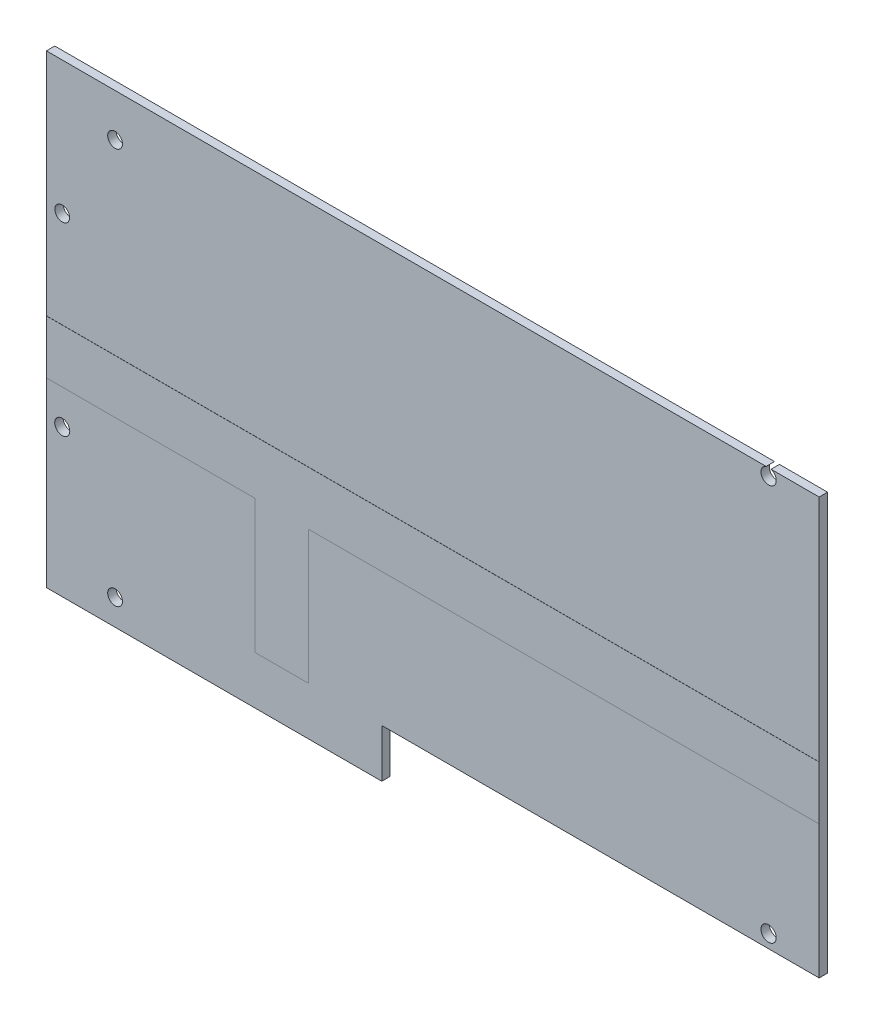
ISO-10303-21;
HEADER;
FILE_DESCRIPTION(('STEP AP214'),'2;1');
FILE_NAME('part.step','',(''),(''),'','','');
FILE_SCHEMA(('AUTOMOTIVE_DESIGN { 1 0 10303 214 1 1 1 1 }'));
ENDSEC;
DATA;
#1=APPLICATION_CONTEXT('core data for automotive mechanical design processes');
#2=APPLICATION_PROTOCOL_DEFINITION('international standard','automotive_design',2000,#1);
#3=PRODUCT_CONTEXT('',#1,'mechanical');
#4=PRODUCT('Part','Part','',(#3));
#5=PRODUCT_RELATED_PRODUCT_CATEGORY('part','',(#4));
#6=PRODUCT_DEFINITION_FORMATION('','',#4);
#7=PRODUCT_DEFINITION_CONTEXT('part definition',#1,'design');
#8=PRODUCT_DEFINITION('design','',#6,#7);
#9=PRODUCT_DEFINITION_SHAPE('','',#8);
#10=(LENGTH_UNIT() NAMED_UNIT(*) SI_UNIT(.MILLI.,.METRE.));
#11=(NAMED_UNIT(*) PLANE_ANGLE_UNIT() SI_UNIT($,.RADIAN.));
#12=(NAMED_UNIT(*) SI_UNIT($,.STERADIAN.) SOLID_ANGLE_UNIT());
#13=UNCERTAINTY_MEASURE_WITH_UNIT(LENGTH_MEASURE(1.E-05),#10,'distance_accuracy_value','');
#14=(GEOMETRIC_REPRESENTATION_CONTEXT(3) GLOBAL_UNCERTAINTY_ASSIGNED_CONTEXT((#13)) GLOBAL_UNIT_ASSIGNED_CONTEXT((#10,
#11,#12)) REPRESENTATION_CONTEXT('',''));
#15=CARTESIAN_POINT('',(0.,0.,0.));
#16=DIRECTION('',(0.,0.,1.));
#17=DIRECTION('',(1.,0.,0.));
#18=AXIS2_PLACEMENT_3D('',#15,#16,#17);
#19=CARTESIAN_POINT('',(-73.152,-30.353,1.5875));
#20=DIRECTION('',(0.,1.,0.));
#21=DIRECTION('',(-1.,0.,0.));
#22=AXIS2_PLACEMENT_3D('',#19,#20,#21);
#23=PLANE('',#22);
#24=DIRECTION('',(1.,0.,0.));
#25=VECTOR('',#24,1.);
#26=CARTESIAN_POINT('',(-73.152,-30.353,0.));
#27=LINE('',#26,#25);
#28=CARTESIAN_POINT('',(-33.6423,-30.353,0.));
#29=VERTEX_POINT('',#28);
#30=CARTESIAN_POINT('',(-23.4823,-30.353,0.));
#31=VERTEX_POINT('',#30);
#32=EDGE_CURVE('E11',#29,#31,#27,.T.);
#33=ORIENTED_EDGE('',*,*,#32,.F.);
#34=DIRECTION('',(0.,0.,1.));
#35=VECTOR('',#34,1.);
#36=CARTESIAN_POINT('',(-33.6423,-30.353,-0.0379000000000002));
#37=LINE('',#36,#35);
#38=CARTESIAN_POINT('',(-33.6423,-30.353,-0.0379000000000002));
#39=VERTEX_POINT('',#38);
#40=EDGE_CURVE('E354',#39,#29,#37,.T.);
#41=ORIENTED_EDGE('',*,*,#40,.F.);
#42=DIRECTION('',(1.,0.,0.));
#43=VECTOR('',#42,1.);
#44=CARTESIAN_POINT('',(-33.6423,-30.353,-0.0379000000000002));
#45=LINE('',#44,#43);
#46=CARTESIAN_POINT('',(-23.4823,-30.353,-0.0379000000000002));
#47=VERTEX_POINT('',#46);
#48=EDGE_CURVE('E310',#39,#47,#45,.T.);
#49=ORIENTED_EDGE('',*,*,#48,.T.);
#50=DIRECTION('',(0.,0.,1.));
#51=VECTOR('',#50,1.);
#52=CARTESIAN_POINT('',(-23.4823,-30.353,-0.0379000000000002));
#53=LINE('',#52,#51);
#54=EDGE_CURVE('E349',#47,#31,#53,.T.);
#55=ORIENTED_EDGE('',*,*,#54,.T.);
#56=EDGE_LOOP('',(#33,#41,#49,#55));
#57=FACE_BOUND('',#56,.T.);
#58=ADVANCED_FACE('F41',(#57),#23,.F.);
#59=DIRECTION('',(-1.,0.,0.));
#60=VECTOR('',#59,1.);
#61=CARTESIAN_POINT('',(-73.152,-30.353,1.5875));
#62=LINE('',#61,#60);
#63=CARTESIAN_POINT('',(-23.4823,-30.353,1.5875));
#64=VERTEX_POINT('',#63);
#65=CARTESIAN_POINT('',(-33.6423,-30.353,1.5875));
#66=VERTEX_POINT('',#65);
#67=EDGE_CURVE('E51',#64,#66,#62,.T.);
#68=ORIENTED_EDGE('',*,*,#67,.F.);
#69=CARTESIAN_POINT('',(-23.4823,-30.353,1.6129));
#70=VERTEX_POINT('',#69);
#71=EDGE_CURVE('E353',#64,#70,#53,.T.);
#72=ORIENTED_EDGE('',*,*,#71,.T.);
#73=DIRECTION('',(1.,0.,0.));
#74=VECTOR('',#73,1.);
#75=CARTESIAN_POINT('',(-33.6423,-30.353,1.6129));
#76=LINE('',#75,#74);
#77=CARTESIAN_POINT('',(-33.6423,-30.353,1.6129));
#78=VERTEX_POINT('',#77);
#79=EDGE_CURVE('E278',#78,#70,#76,.T.);
#80=ORIENTED_EDGE('',*,*,#79,.F.);
#81=EDGE_CURVE('E358',#66,#78,#37,.T.);
#82=ORIENTED_EDGE('',*,*,#81,.F.);
#83=EDGE_LOOP('',(#68,#72,#80,#82));
#84=FACE_BOUND('',#83,.T.);
#85=ADVANCED_FACE('F486',(#84),#23,.F.);
#86=DIRECTION('',(0.,0.,1.));
#87=VECTOR('',#86,1.);
#88=CARTESIAN_POINT('',(-9.65200000000001,-30.353,-64.1549899540168));
#89=LINE('',#88,#87);
#90=CARTESIAN_POINT('',(-9.65200000000001,-30.353,0.));
#91=VERTEX_POINT('',#90);
#92=CARTESIAN_POINT('',(-9.65200000000001,-30.353,1.5875));
#93=VERTEX_POINT('',#92);
#94=EDGE_CURVE('E59',#91,#93,#89,.T.);
#95=ORIENTED_EDGE('',*,*,#94,.F.);
#96=DIRECTION('',(1.,0.,0.));
#97=VECTOR('',#96,1.);
#98=CARTESIAN_POINT('',(-73.152,-30.353,0.));
#99=LINE('',#98,#97);
#100=CARTESIAN_POINT('',(73.152,-30.353,0.));
#101=VERTEX_POINT('',#100);
#102=EDGE_CURVE('E401',#91,#101,#99,.T.);
#103=ORIENTED_EDGE('',*,*,#102,.T.);
#104=DIRECTION('',(0.,0.,-1.));
#105=VECTOR('',#104,1.);
#106=CARTESIAN_POINT('',(73.152,-30.353,1.5875));
#107=LINE('',#106,#105);
#108=CARTESIAN_POINT('',(73.152,-30.353,1.5875));
#109=VERTEX_POINT('',#108);
#110=EDGE_CURVE('E420',#109,#101,#107,.T.);
#111=ORIENTED_EDGE('',*,*,#110,.F.);
#112=DIRECTION('',(1.,0.,0.));
#113=VECTOR('',#112,1.);
#114=CARTESIAN_POINT('',(-73.152,-30.353,1.5875));
#115=LINE('',#114,#113);
#116=EDGE_CURVE('E384',#93,#109,#115,.T.);
#117=ORIENTED_EDGE('',*,*,#116,.F.);
#118=EDGE_LOOP('',(#95,#103,#111,#117));
#119=FACE_BOUND('',#118,.T.);
#120=ADVANCED_FACE('F488',(#119),#23,.F.);
#121=CARTESIAN_POINT('',(-73.152,48.514,1.5875));
#122=DIRECTION('',(0.,-1.,0.));
#123=DIRECTION('',(0.,0.,-1.));
#124=AXIS2_PLACEMENT_3D('',#121,#122,#123);
#125=PLANE('',#124);
#126=DIRECTION('',(-1.,0.,0.));
#127=VECTOR('',#126,1.);
#128=CARTESIAN_POINT('',(-73.152,48.514,0.));
#129=LINE('',#128,#127);
#130=CARTESIAN_POINT('',(73.152,48.514,0.));
#131=VERTEX_POINT('',#130);
#132=CARTESIAN_POINT('',(64.0483332147094,48.514,0.));
#133=VERTEX_POINT('',#132);
#134=EDGE_CURVE('E218',#131,#133,#129,.T.);
#135=ORIENTED_EDGE('',*,*,#134,.T.);
#136=DIRECTION('',(0.,0.,1.));
#137=VECTOR('',#136,1.);
#138=CARTESIAN_POINT('',(64.0483332147094,48.514,-0.0379000000000002));
#139=LINE('',#138,#137);
#140=CARTESIAN_POINT('',(64.0483332147094,48.514,1.5875));
#141=VERTEX_POINT('',#140);
#142=EDGE_CURVE('E247',#133,#141,#139,.T.);
#143=ORIENTED_EDGE('',*,*,#142,.T.);
#144=DIRECTION('',(-1.,0.,0.));
#145=VECTOR('',#144,1.);
#146=CARTESIAN_POINT('',(-73.152,48.514,1.5875));
#147=LINE('',#146,#145);
#148=CARTESIAN_POINT('',(73.152,48.514,1.5875));
#149=VERTEX_POINT('',#148);
#150=EDGE_CURVE('E392',#149,#141,#147,.T.);
#151=ORIENTED_EDGE('',*,*,#150,.F.);
#152=DIRECTION('',(0.,0.,-1.));
#153=VECTOR('',#152,1.);
#154=CARTESIAN_POINT('',(73.152,48.514,1.5875));
#155=LINE('',#154,#153);
#156=EDGE_CURVE('E416',#149,#131,#155,.T.);
#157=ORIENTED_EDGE('',*,*,#156,.T.);
#158=EDGE_LOOP('',(#135,#143,#151,#157));
#159=FACE_BOUND('',#158,.T.);
#160=ADVANCED_FACE('F495',(#159),#125,.F.);
#161=CARTESIAN_POINT('',(0.,0.,1.5875));
#162=DIRECTION('',(0.,0.,1.));
#163=DIRECTION('',(1.,0.,0.));
#164=AXIS2_PLACEMENT_3D('',#161,#162,#163);
#165=PLANE('',#164);
#166=CARTESIAN_POINT('',(-60.152,40.424999886,1.5875));
#167=DIRECTION('',(0.,0.,1.));
#168=DIRECTION('',(1.,0.,0.));
#169=AXIS2_PLACEMENT_3D('',#166,#167,#168);
#170=CIRCLE('',#169,1.39700000000001);
#171=CARTESIAN_POINT('',(-58.755,40.424999886,1.5875));
#172=VERTEX_POINT('',#171);
#173=EDGE_CURVE('E549',#172,#172,#170,.T.);
#174=ORIENTED_EDGE('',*,*,#173,.F.);
#175=EDGE_LOOP('',(#174));
#176=FACE_BOUND('',#175,.T.);
#177=CARTESIAN_POINT('',(-70.152,23.35,1.5875));
#178=DIRECTION('',(0.,0.,1.));
#179=DIRECTION('',(1.,0.,0.));
#180=AXIS2_PLACEMENT_3D('',#177,#178,#179);
#181=CIRCLE('',#180,1.39700000000001);
#182=CARTESIAN_POINT('',(-68.755,23.35,1.5875));
#183=VERTEX_POINT('',#182);
#184=EDGE_CURVE('E458',#183,#183,#181,.T.);
#185=ORIENTED_EDGE('',*,*,#184,.F.);
#186=EDGE_LOOP('',(#185));
#187=FACE_BOUND('',#186,.T.);
#188=CARTESIAN_POINT('',(63.58,47.147,1.5875));
#189=DIRECTION('',(0.,0.,1.));
#190=DIRECTION('',(1.,0.,0.));
#191=AXIS2_PLACEMENT_3D('',#188,#189,#190);
#192=CIRCLE('',#191,1.44500000000001);
#193=CARTESIAN_POINT('',(63.1116667852906,48.514,1.5875));
#194=VERTEX_POINT('',#193);
#195=EDGE_CURVE('E257',#194,#141,#192,.T.);
#196=ORIENTED_EDGE('',*,*,#195,.F.);
#197=CARTESIAN_POINT('',(-73.152,48.514,1.5875));
#198=VERTEX_POINT('',#197);
#199=EDGE_CURVE('E391',#194,#198,#147,.T.);
#200=ORIENTED_EDGE('',*,*,#199,.T.);
#201=DIRECTION('',(0.,-1.,0.));
#202=VECTOR('',#201,1.);
#203=CARTESIAN_POINT('',(-73.152,48.514,1.5875));
#204=LINE('',#203,#202);
#205=CARTESIAN_POINT('',(-73.152,5.08000000000002,1.5875));
#206=VERTEX_POINT('',#205);
#207=EDGE_CURVE('E217',#198,#206,#204,.T.);
#208=ORIENTED_EDGE('',*,*,#207,.T.);
#209=DIRECTION('',(-1.,0.,0.));
#210=VECTOR('',#209,1.);
#211=CARTESIAN_POINT('',(0.,5.08,1.5875));
#212=LINE('',#211,#210);
#213=CARTESIAN_POINT('',(73.152,5.08000000000002,1.5875));
#214=VERTEX_POINT('',#213);
#215=EDGE_CURVE('E379',#214,#206,#212,.T.);
#216=ORIENTED_EDGE('',*,*,#215,.F.);
#217=DIRECTION('',(0.,1.,0.));
#218=VECTOR('',#217,1.);
#219=CARTESIAN_POINT('',(73.152,48.514,1.5875));
#220=LINE('',#219,#218);
#221=EDGE_CURVE('E387',#214,#149,#220,.T.);
#222=ORIENTED_EDGE('',*,*,#221,.T.);
#223=ORIENTED_EDGE('',*,*,#150,.T.);
#224=EDGE_LOOP('',(#196,#200,#208,#216,#222,#223));
#225=FACE_BOUND('',#224,.T.);
#226=ADVANCED_FACE('F499',(#176,#187,#225),#165,.T.);
#227=CARTESIAN_POINT('',(0.,0.,0.));
#228=DIRECTION('',(0.,0.,1.));
#229=DIRECTION('',(1.,0.,0.));
#230=AXIS2_PLACEMENT_3D('',#227,#228,#229);
#231=PLANE('',#230);
#232=CARTESIAN_POINT('',(-60.152,40.424999886,0.));
#233=DIRECTION('',(0.,0.,1.));
#234=DIRECTION('',(1.,0.,0.));
#235=AXIS2_PLACEMENT_3D('',#232,#233,#234);
#236=CIRCLE('',#235,1.39700000000001);
#237=CARTESIAN_POINT('',(-58.755,40.424999886,0.));
#238=VERTEX_POINT('',#237);
#239=EDGE_CURVE('E45',#238,#238,#236,.T.);
#240=ORIENTED_EDGE('',*,*,#239,.T.);
#241=EDGE_LOOP('',(#240));
#242=FACE_BOUND('',#241,.T.);
#243=CARTESIAN_POINT('',(-70.152,23.35,0.));
#244=DIRECTION('',(0.,0.,1.));
#245=DIRECTION('',(1.,0.,0.));
#246=AXIS2_PLACEMENT_3D('',#243,#244,#245);
#247=CIRCLE('',#246,1.39700000000001);
#248=CARTESIAN_POINT('',(-68.755,23.35,0.));
#249=VERTEX_POINT('',#248);
#250=EDGE_CURVE('E241',#249,#249,#247,.T.);
#251=ORIENTED_EDGE('',*,*,#250,.T.);
#252=EDGE_LOOP('',(#251));
#253=FACE_BOUND('',#252,.T.);
#254=CARTESIAN_POINT('',(63.1116667852906,48.514,0.));
#255=VERTEX_POINT('',#254);
#256=CARTESIAN_POINT('',(-73.152,48.514,0.));
#257=VERTEX_POINT('',#256);
#258=EDGE_CURVE('E409',#255,#257,#129,.T.);
#259=ORIENTED_EDGE('',*,*,#258,.F.);
#260=CARTESIAN_POINT('',(63.58,47.147,0.));
#261=DIRECTION('',(0.,0.,1.));
#262=DIRECTION('',(1.,0.,0.));
#263=AXIS2_PLACEMENT_3D('',#260,#261,#262);
#264=CIRCLE('',#263,1.44500000000001);
#265=EDGE_CURVE('E67',#255,#133,#264,.T.);
#266=ORIENTED_EDGE('',*,*,#265,.T.);
#267=ORIENTED_EDGE('',*,*,#134,.F.);
#268=DIRECTION('',(0.,1.,0.));
#269=VECTOR('',#268,1.);
#270=CARTESIAN_POINT('',(73.152,48.514,0.));
#271=LINE('',#270,#269);
#272=CARTESIAN_POINT('',(73.152,5.08,0.));
#273=VERTEX_POINT('',#272);
#274=EDGE_CURVE('E404',#273,#131,#271,.T.);
#275=ORIENTED_EDGE('',*,*,#274,.F.);
#276=DIRECTION('',(-1.,0.,0.));
#277=VECTOR('',#276,1.);
#278=CARTESIAN_POINT('',(0.,5.08,0.));
#279=LINE('',#278,#277);
#280=CARTESIAN_POINT('',(-73.152,5.08,0.));
#281=VERTEX_POINT('',#280);
#282=EDGE_CURVE('E440',#273,#281,#279,.T.);
#283=ORIENTED_EDGE('',*,*,#282,.T.);
#284=DIRECTION('',(0.,-1.,0.));
#285=VECTOR('',#284,1.);
#286=CARTESIAN_POINT('',(-73.152,48.514,0.));
#287=LINE('',#286,#285);
#288=EDGE_CURVE('E397',#257,#281,#287,.T.);
#289=ORIENTED_EDGE('',*,*,#288,.F.);
#290=EDGE_LOOP('',(#259,#266,#267,#275,#283,#289));
#291=FACE_BOUND('',#290,.T.);
#292=ADVANCED_FACE('F465',(#242,#253,#291),#231,.F.);
#293=CARTESIAN_POINT('',(-73.152,48.514,1.5875));
#294=DIRECTION('',(1.,0.,0.));
#295=DIRECTION('',(0.,0.,-1.));
#296=AXIS2_PLACEMENT_3D('',#293,#294,#295);
#297=PLANE('',#296);
#298=CARTESIAN_POINT('',(-73.152,-5.07999999999999,1.5875));
#299=VERTEX_POINT('',#298);
#300=CARTESIAN_POINT('',(-73.152,-39.497,1.5875));
#301=VERTEX_POINT('',#300);
#302=EDGE_CURVE('E205',#299,#301,#204,.T.);
#303=ORIENTED_EDGE('',*,*,#302,.F.);
#304=DIRECTION('',(0.,0.,1.));
#305=VECTOR('',#304,1.);
#306=CARTESIAN_POINT('',(-73.152,-5.08,-0.0379000000000002));
#307=LINE('',#306,#305);
#308=CARTESIAN_POINT('',(-73.152,-5.08,1.6129));
#309=VERTEX_POINT('',#308);
#310=EDGE_CURVE('E330',#299,#309,#307,.T.);
#311=ORIENTED_EDGE('',*,*,#310,.T.);
#312=DIRECTION('',(0.,-1.,0.));
#313=VECTOR('',#312,1.);
#314=CARTESIAN_POINT('',(-73.152,5.08,1.6129));
#315=LINE('',#314,#313);
#316=CARTESIAN_POINT('',(-73.152,5.08,1.6129));
#317=VERTEX_POINT('',#316);
#318=EDGE_CURVE('E266',#317,#309,#315,.T.);
#319=ORIENTED_EDGE('',*,*,#318,.F.);
#320=DIRECTION('',(0.,0.,1.));
#321=VECTOR('',#320,1.);
#322=CARTESIAN_POINT('',(-73.152,5.08,-0.0379000000000002));
#323=LINE('',#322,#321);
#324=EDGE_CURVE('E334',#206,#317,#323,.T.);
#325=ORIENTED_EDGE('',*,*,#324,.F.);
#326=ORIENTED_EDGE('',*,*,#207,.F.);
#327=DIRECTION('',(0.,0.,-1.));
#328=VECTOR('',#327,1.);
#329=CARTESIAN_POINT('',(-73.152,48.514,1.5875));
#330=LINE('',#329,#328);
#331=EDGE_CURVE('E396',#198,#257,#330,.T.);
#332=ORIENTED_EDGE('',*,*,#331,.T.);
#333=ORIENTED_EDGE('',*,*,#288,.T.);
#334=CARTESIAN_POINT('',(-73.152,5.08,-0.0379000000000002));
#335=VERTEX_POINT('',#334);
#336=EDGE_CURVE('E331',#335,#281,#323,.T.);
#337=ORIENTED_EDGE('',*,*,#336,.F.);
#338=DIRECTION('',(0.,-1.,0.));
#339=VECTOR('',#338,1.);
#340=CARTESIAN_POINT('',(-73.152,5.08,-0.0379000000000002));
#341=LINE('',#340,#339);
#342=CARTESIAN_POINT('',(-73.152,-5.08,-0.0379000000000002));
#343=VERTEX_POINT('',#342);
#344=EDGE_CURVE('E298',#335,#343,#341,.T.);
#345=ORIENTED_EDGE('',*,*,#344,.T.);
#346=CARTESIAN_POINT('',(-73.152,-5.08,0.));
#347=VERTEX_POINT('',#346);
#348=EDGE_CURVE('E363',#343,#347,#307,.T.);
#349=ORIENTED_EDGE('',*,*,#348,.T.);
#350=CARTESIAN_POINT('',(-73.152,-39.497,0.));
#351=VERTEX_POINT('',#350);
#352=EDGE_CURVE('E224',#347,#351,#287,.T.);
#353=ORIENTED_EDGE('',*,*,#352,.T.);
#354=DIRECTION('',(0.,0.,1.));
#355=VECTOR('',#354,1.);
#356=CARTESIAN_POINT('',(-73.152,-39.497,-64.1549899540168));
#357=LINE('',#356,#355);
#358=EDGE_CURVE('E221',#351,#301,#357,.T.);
#359=ORIENTED_EDGE('',*,*,#358,.T.);
#360=EDGE_LOOP('',(#303,#311,#319,#325,#326,#332,#333,#337,#345,#349,#353,#359));
#361=FACE_BOUND('',#360,.T.);
#362=ADVANCED_FACE('F43',(#361),#297,.F.);
#363=CARTESIAN_POINT('',(73.152,48.514,1.5875));
#364=DIRECTION('',(-1.,0.,0.));
#365=DIRECTION('',(0.,-1.,0.));
#366=AXIS2_PLACEMENT_3D('',#363,#364,#365);
#367=PLANE('',#366);
#368=CARTESIAN_POINT('',(73.152,-5.08,0.));
#369=VERTEX_POINT('',#368);
#370=EDGE_CURVE('E405',#101,#369,#271,.T.);
#371=ORIENTED_EDGE('',*,*,#370,.T.);
#372=DIRECTION('',(0.,0.,1.));
#373=VECTOR('',#372,1.);
#374=CARTESIAN_POINT('',(73.152,-5.08,-0.0379000000000002));
#375=LINE('',#374,#373);
#376=CARTESIAN_POINT('',(73.152,-5.08,-0.0379000000000002));
#377=VERTEX_POINT('',#376);
#378=EDGE_CURVE('E340',#377,#369,#375,.T.);
#379=ORIENTED_EDGE('',*,*,#378,.F.);
#380=DIRECTION('',(0.,1.,0.));
#381=VECTOR('',#380,1.);
#382=CARTESIAN_POINT('',(73.152,5.08,-0.0379000000000002));
#383=LINE('',#382,#381);
#384=CARTESIAN_POINT('',(73.152,5.08,-0.0379000000000002));
#385=VERTEX_POINT('',#384);
#386=EDGE_CURVE('E322',#377,#385,#383,.T.);
#387=ORIENTED_EDGE('',*,*,#386,.T.);
#388=DIRECTION('',(0.,0.,1.));
#389=VECTOR('',#388,1.);
#390=CARTESIAN_POINT('',(73.152,5.08,-0.0379000000000002));
#391=LINE('',#390,#389);
#392=EDGE_CURVE('E335',#385,#273,#391,.T.);
#393=ORIENTED_EDGE('',*,*,#392,.T.);
#394=ORIENTED_EDGE('',*,*,#274,.T.);
#395=ORIENTED_EDGE('',*,*,#156,.F.);
#396=ORIENTED_EDGE('',*,*,#221,.F.);
#397=CARTESIAN_POINT('',(73.152,5.08,1.6129));
#398=VERTEX_POINT('',#397);
#399=EDGE_CURVE('E339',#214,#398,#391,.T.);
#400=ORIENTED_EDGE('',*,*,#399,.T.);
#401=DIRECTION('',(0.,1.,0.));
#402=VECTOR('',#401,1.);
#403=CARTESIAN_POINT('',(73.152,5.08,1.6129));
#404=LINE('',#403,#402);
#405=CARTESIAN_POINT('',(73.152,-5.08,1.6129));
#406=VERTEX_POINT('',#405);
#407=EDGE_CURVE('E290',#406,#398,#404,.T.);
#408=ORIENTED_EDGE('',*,*,#407,.F.);
#409=CARTESIAN_POINT('',(73.152,-5.07999999999999,1.5875));
#410=VERTEX_POINT('',#409);
#411=EDGE_CURVE('E343',#410,#406,#375,.T.);
#412=ORIENTED_EDGE('',*,*,#411,.F.);
#413=EDGE_CURVE('E388',#109,#410,#220,.T.);
#414=ORIENTED_EDGE('',*,*,#413,.F.);
#415=ORIENTED_EDGE('',*,*,#110,.T.);
#416=EDGE_LOOP('',(#371,#379,#387,#393,#394,#395,#396,#400,#408,#412,#414,#415));
#417=FACE_BOUND('',#416,.T.);
#418=ADVANCED_FACE('F510',(#417),#367,.F.);
#419=ORIENTED_EDGE('',*,*,#199,.F.);
#420=DIRECTION('',(0.,0.,1.));
#421=VECTOR('',#420,1.);
#422=CARTESIAN_POINT('',(63.1116667852906,48.514,-0.0379000000000002));
#423=LINE('',#422,#421);
#424=EDGE_CURVE('E444',#194,#255,#423,.F.);
#425=ORIENTED_EDGE('',*,*,#424,.T.);
#426=ORIENTED_EDGE('',*,*,#258,.T.);
#427=ORIENTED_EDGE('',*,*,#331,.F.);
#428=EDGE_LOOP('',(#419,#425,#426,#427));
#429=FACE_BOUND('',#428,.T.);
#430=ADVANCED_FACE('F502',(#429),#125,.F.);
#431=CARTESIAN_POINT('',(-60.152,-34.575,1.5875));
#432=DIRECTION('',(0.,0.,1.));
#433=DIRECTION('',(1.,0.,0.));
#434=AXIS2_PLACEMENT_3D('',#431,#432,#433);
#435=CIRCLE('',#434,1.39700000000001);
#436=CARTESIAN_POINT('',(-58.755,-34.575,1.5875));
#437=VERTEX_POINT('',#436);
#438=EDGE_CURVE('E545',#437,#437,#435,.T.);
#439=ORIENTED_EDGE('',*,*,#438,.F.);
#440=EDGE_LOOP('',(#439));
#441=FACE_BOUND('',#440,.T.);
#442=CARTESIAN_POINT('',(-70.152,-11.65,1.5875));
#443=DIRECTION('',(0.,0.,1.));
#444=DIRECTION('',(1.,0.,0.));
#445=AXIS2_PLACEMENT_3D('',#442,#443,#444);
#446=CIRCLE('',#445,1.42501507229677);
#447=CARTESIAN_POINT('',(-68.7269849277033,-11.65,1.5875));
#448=VERTEX_POINT('',#447);
#449=EDGE_CURVE('E544',#448,#448,#446,.T.);
#450=ORIENTED_EDGE('',*,*,#449,.F.);
#451=EDGE_LOOP('',(#450));
#452=FACE_BOUND('',#451,.T.);
#453=DIRECTION('',(0.,-1.,0.));
#454=VECTOR('',#453,1.);
#455=CARTESIAN_POINT('',(-33.6423,0.,1.5875));
#456=LINE('',#455,#454);
#457=CARTESIAN_POINT('',(-33.6423,-5.08,1.5875));
#458=VERTEX_POINT('',#457);
#459=EDGE_CURVE('E368',#458,#66,#456,.T.);
#460=ORIENTED_EDGE('',*,*,#459,.F.);
#461=DIRECTION('',(1.,0.,0.));
#462=VECTOR('',#461,1.);
#463=CARTESIAN_POINT('',(0.,-5.08,1.5875));
#464=LINE('',#463,#462);
#465=EDGE_CURVE('E213',#299,#458,#464,.T.);
#466=ORIENTED_EDGE('',*,*,#465,.F.);
#467=ORIENTED_EDGE('',*,*,#302,.T.);
#468=DIRECTION('',(1.,0.,0.));
#469=VECTOR('',#468,1.);
#470=CARTESIAN_POINT('',(-73.152,-39.497,1.5875));
#471=LINE('',#470,#469);
#472=CARTESIAN_POINT('',(-9.65200000000001,-39.497,1.5875));
#473=VERTEX_POINT('',#472);
#474=EDGE_CURVE('E211',#301,#473,#471,.T.);
#475=ORIENTED_EDGE('',*,*,#474,.T.);
#476=DIRECTION('',(0.,1.,0.));
#477=VECTOR('',#476,1.);
#478=CARTESIAN_POINT('',(-9.65200000000001,-30.353,1.5875));
#479=LINE('',#478,#477);
#480=EDGE_CURVE('E230',#473,#93,#479,.T.);
#481=ORIENTED_EDGE('',*,*,#480,.T.);
#482=ORIENTED_EDGE('',*,*,#116,.T.);
#483=ORIENTED_EDGE('',*,*,#413,.T.);
#484=DIRECTION('',(1.,0.,0.));
#485=VECTOR('',#484,1.);
#486=CARTESIAN_POINT('',(0.,-5.08,1.5875));
#487=LINE('',#486,#485);
#488=CARTESIAN_POINT('',(-23.4823,-5.08,1.5875));
#489=VERTEX_POINT('',#488);
#490=EDGE_CURVE('E375',#489,#410,#487,.T.);
#491=ORIENTED_EDGE('',*,*,#490,.F.);
#492=DIRECTION('',(0.,1.,0.));
#493=VECTOR('',#492,1.);
#494=CARTESIAN_POINT('',(-23.4823,0.,1.5875));
#495=LINE('',#494,#493);
#496=EDGE_CURVE('E371',#64,#489,#495,.T.);
#497=ORIENTED_EDGE('',*,*,#496,.F.);
#498=ORIENTED_EDGE('',*,*,#67,.T.);
#499=EDGE_LOOP('',(#460,#466,#467,#475,#481,#482,#483,#491,#497,#498));
#500=FACE_BOUND('',#499,.T.);
#501=CARTESIAN_POINT('',(63.58,-27.853,1.5875));
#502=DIRECTION('',(0.,0.,1.));
#503=DIRECTION('',(1.,0.,0.));
#504=AXIS2_PLACEMENT_3D('',#501,#502,#503);
#505=CIRCLE('',#504,1.44500000000001);
#506=CARTESIAN_POINT('',(65.025,-27.853,1.5875));
#507=VERTEX_POINT('',#506);
#508=EDGE_CURVE('E256',#507,#507,#505,.T.);
#509=ORIENTED_EDGE('',*,*,#508,.F.);
#510=EDGE_LOOP('',(#509));
#511=FACE_BOUND('',#510,.T.);
#512=ADVANCED_FACE('F207',(#441,#452,#500,#511),#165,.T.);
#513=CARTESIAN_POINT('',(-60.152,-34.575,0.));
#514=DIRECTION('',(0.,0.,1.));
#515=DIRECTION('',(1.,0.,0.));
#516=AXIS2_PLACEMENT_3D('',#513,#514,#515);
#517=CIRCLE('',#516,1.39700000000001);
#518=CARTESIAN_POINT('',(-58.755,-34.575,0.));
#519=VERTEX_POINT('',#518);
#520=EDGE_CURVE('E457',#519,#519,#517,.T.);
#521=ORIENTED_EDGE('',*,*,#520,.T.);
#522=EDGE_LOOP('',(#521));
#523=FACE_BOUND('',#522,.T.);
#524=CARTESIAN_POINT('',(-70.152,-11.65,0.));
#525=DIRECTION('',(0.,0.,1.));
#526=DIRECTION('',(1.,0.,0.));
#527=AXIS2_PLACEMENT_3D('',#524,#525,#526);
#528=CIRCLE('',#527,1.42501507229677);
#529=CARTESIAN_POINT('',(-68.7269849277033,-11.65,0.));
#530=VERTEX_POINT('',#529);
#531=EDGE_CURVE('E453',#530,#530,#528,.T.);
#532=ORIENTED_EDGE('',*,*,#531,.T.);
#533=EDGE_LOOP('',(#532));
#534=FACE_BOUND('',#533,.T.);
#535=DIRECTION('',(1.,0.,0.));
#536=VECTOR('',#535,1.);
#537=CARTESIAN_POINT('',(0.,-5.08,0.));
#538=LINE('',#537,#536);
#539=CARTESIAN_POINT('',(-33.6423,-5.08,0.));
#540=VERTEX_POINT('',#539);
#541=EDGE_CURVE('E424',#347,#540,#538,.T.);
#542=ORIENTED_EDGE('',*,*,#541,.T.);
#543=DIRECTION('',(0.,-1.,0.));
#544=VECTOR('',#543,1.);
#545=CARTESIAN_POINT('',(-33.6423,0.,0.));
#546=LINE('',#545,#544);
#547=EDGE_CURVE('E428',#540,#29,#546,.T.);
#548=ORIENTED_EDGE('',*,*,#547,.T.);
#549=ORIENTED_EDGE('',*,*,#32,.T.);
#550=DIRECTION('',(0.,1.,0.));
#551=VECTOR('',#550,1.);
#552=CARTESIAN_POINT('',(-23.4823,0.,0.));
#553=LINE('',#552,#551);
#554=CARTESIAN_POINT('',(-23.4823,-5.08,0.));
#555=VERTEX_POINT('',#554);
#556=EDGE_CURVE('E432',#31,#555,#553,.T.);
#557=ORIENTED_EDGE('',*,*,#556,.T.);
#558=DIRECTION('',(1.,0.,0.));
#559=VECTOR('',#558,1.);
#560=CARTESIAN_POINT('',(0.,-5.08,0.));
#561=LINE('',#560,#559);
#562=EDGE_CURVE('E436',#555,#369,#561,.T.);
#563=ORIENTED_EDGE('',*,*,#562,.T.);
#564=ORIENTED_EDGE('',*,*,#370,.F.);
#565=ORIENTED_EDGE('',*,*,#102,.F.);
#566=DIRECTION('',(0.,-1.,0.));
#567=VECTOR('',#566,1.);
#568=CARTESIAN_POINT('',(-9.65200000000001,-30.353,0.));
#569=LINE('',#568,#567);
#570=CARTESIAN_POINT('',(-9.65200000000001,-39.497,0.));
#571=VERTEX_POINT('',#570);
#572=EDGE_CURVE('E250',#91,#571,#569,.T.);
#573=ORIENTED_EDGE('',*,*,#572,.T.);
#574=DIRECTION('',(-1.,0.,0.));
#575=VECTOR('',#574,1.);
#576=CARTESIAN_POINT('',(-73.152,-39.497,0.));
#577=LINE('',#576,#575);
#578=EDGE_CURVE('E253',#571,#351,#577,.T.);
#579=ORIENTED_EDGE('',*,*,#578,.T.);
#580=ORIENTED_EDGE('',*,*,#352,.F.);
#581=EDGE_LOOP('',(#542,#548,#549,#557,#563,#564,#565,#573,#579,#580));
#582=FACE_BOUND('',#581,.T.);
#583=CARTESIAN_POINT('',(63.58,-27.853,0.));
#584=DIRECTION('',(0.,0.,1.));
#585=DIRECTION('',(1.,0.,0.));
#586=AXIS2_PLACEMENT_3D('',#583,#584,#585);
#587=CIRCLE('',#586,1.44500000000001);
#588=CARTESIAN_POINT('',(65.025,-27.853,0.));
#589=VERTEX_POINT('',#588);
#590=EDGE_CURVE('E265',#589,#589,#587,.T.);
#591=ORIENTED_EDGE('',*,*,#590,.T.);
#592=EDGE_LOOP('',(#591));
#593=FACE_BOUND('',#592,.T.);
#594=ADVANCED_FACE('F516',(#523,#534,#582,#593),#231,.F.);
#595=CARTESIAN_POINT('',(0.,0.,-0.0379000000000002));
#596=DIRECTION('',(0.,0.,1.));
#597=DIRECTION('',(1.,0.,0.));
#598=AXIS2_PLACEMENT_3D('',#595,#596,#597);
#599=PLANE('',#598);
#600=ORIENTED_EDGE('',*,*,#344,.F.);
#601=DIRECTION('',(-1.,0.,0.));
#602=VECTOR('',#601,1.);
#603=CARTESIAN_POINT('',(-73.152,5.08,-0.0379000000000002));
#604=LINE('',#603,#602);
#605=EDGE_CURVE('E326',#385,#335,#604,.T.);
#606=ORIENTED_EDGE('',*,*,#605,.F.);
#607=ORIENTED_EDGE('',*,*,#386,.F.);
#608=DIRECTION('',(1.,0.,0.));
#609=VECTOR('',#608,1.);
#610=CARTESIAN_POINT('',(-23.4823,-5.08,-0.0379000000000002));
#611=LINE('',#610,#609);
#612=CARTESIAN_POINT('',(-23.4823,-5.08,-0.0379000000000002));
#613=VERTEX_POINT('',#612);
#614=EDGE_CURVE('E318',#613,#377,#611,.T.);
#615=ORIENTED_EDGE('',*,*,#614,.F.);
#616=DIRECTION('',(0.,1.,0.));
#617=VECTOR('',#616,1.);
#618=CARTESIAN_POINT('',(-23.4823,-5.08,-0.0379000000000002));
#619=LINE('',#618,#617);
#620=EDGE_CURVE('E314',#47,#613,#619,.T.);
#621=ORIENTED_EDGE('',*,*,#620,.F.);
#622=ORIENTED_EDGE('',*,*,#48,.F.);
#623=DIRECTION('',(0.,-1.,0.));
#624=VECTOR('',#623,1.);
#625=CARTESIAN_POINT('',(-33.6423,-5.08,-0.0379000000000002));
#626=LINE('',#625,#624);
#627=CARTESIAN_POINT('',(-33.6423,-5.08,-0.0379000000000002));
#628=VERTEX_POINT('',#627);
#629=EDGE_CURVE('E306',#628,#39,#626,.T.);
#630=ORIENTED_EDGE('',*,*,#629,.F.);
#631=DIRECTION('',(1.,0.,0.));
#632=VECTOR('',#631,1.);
#633=CARTESIAN_POINT('',(-73.152,-5.08,-0.0379000000000002));
#634=LINE('',#633,#632);
#635=EDGE_CURVE('E302',#343,#628,#634,.T.);
#636=ORIENTED_EDGE('',*,*,#635,.F.);
#637=EDGE_LOOP('',(#600,#606,#607,#615,#621,#622,#630,#636));
#638=FACE_BOUND('',#637,.T.);
#639=ADVANCED_FACE('F564',(#638),#599,.F.);
#640=CARTESIAN_POINT('',(-73.152,-5.08,-0.0379000000000002));
#641=DIRECTION('',(0.,-1.,0.));
#642=DIRECTION('',(0.,0.,-1.));
#643=AXIS2_PLACEMENT_3D('',#640,#641,#642);
#644=PLANE('',#643);
#645=ORIENTED_EDGE('',*,*,#541,.F.);
#646=ORIENTED_EDGE('',*,*,#348,.F.);
#647=ORIENTED_EDGE('',*,*,#635,.T.);
#648=DIRECTION('',(0.,0.,1.));
#649=VECTOR('',#648,1.);
#650=CARTESIAN_POINT('',(-33.6423,-5.08,-0.0379000000000002));
#651=LINE('',#650,#649);
#652=EDGE_CURVE('E359',#628,#540,#651,.T.);
#653=ORIENTED_EDGE('',*,*,#652,.T.);
#654=EDGE_LOOP('',(#645,#646,#647,#653));
#655=FACE_BOUND('',#654,.T.);
#656=ADVANCED_FACE('F590',(#655),#644,.T.);
#657=CARTESIAN_POINT('',(-33.6423,-5.08,-0.0379000000000002));
#658=DIRECTION('',(-1.,0.,0.));
#659=DIRECTION('',(0.,0.,1.));
#660=AXIS2_PLACEMENT_3D('',#657,#658,#659);
#661=PLANE('',#660);
#662=ORIENTED_EDGE('',*,*,#547,.F.);
#663=ORIENTED_EDGE('',*,*,#652,.F.);
#664=ORIENTED_EDGE('',*,*,#629,.T.);
#665=ORIENTED_EDGE('',*,*,#40,.T.);
#666=EDGE_LOOP('',(#662,#663,#664,#665));
#667=FACE_BOUND('',#666,.T.);
#668=ADVANCED_FACE('F611',(#667),#661,.T.);
#669=CARTESIAN_POINT('',(-23.4823,-5.08,-0.0379000000000002));
#670=DIRECTION('',(1.,0.,0.));
#671=DIRECTION('',(0.,0.,-1.));
#672=AXIS2_PLACEMENT_3D('',#669,#670,#671);
#673=PLANE('',#672);
#674=ORIENTED_EDGE('',*,*,#556,.F.);
#675=ORIENTED_EDGE('',*,*,#54,.F.);
#676=ORIENTED_EDGE('',*,*,#620,.T.);
#677=DIRECTION('',(0.,0.,1.));
#678=VECTOR('',#677,1.);
#679=CARTESIAN_POINT('',(-23.4823,-5.08,-0.0379000000000002));
#680=LINE('',#679,#678);
#681=EDGE_CURVE('E344',#613,#555,#680,.T.);
#682=ORIENTED_EDGE('',*,*,#681,.T.);
#683=EDGE_LOOP('',(#674,#675,#676,#682));
#684=FACE_BOUND('',#683,.T.);
#685=ADVANCED_FACE('F607',(#684),#673,.T.);
#686=CARTESIAN_POINT('',(-23.4823,-5.08,-0.0379000000000002));
#687=DIRECTION('',(0.,-1.,0.));
#688=DIRECTION('',(1.,0.,0.));
#689=AXIS2_PLACEMENT_3D('',#686,#687,#688);
#690=PLANE('',#689);
#691=ORIENTED_EDGE('',*,*,#562,.F.);
#692=ORIENTED_EDGE('',*,*,#681,.F.);
#693=ORIENTED_EDGE('',*,*,#614,.T.);
#694=ORIENTED_EDGE('',*,*,#378,.T.);
#695=EDGE_LOOP('',(#691,#692,#693,#694));
#696=FACE_BOUND('',#695,.T.);
#697=ADVANCED_FACE('F602',(#696),#690,.T.);
#698=CARTESIAN_POINT('',(-73.152,5.08,-0.0379000000000002));
#699=DIRECTION('',(0.,1.,0.));
#700=DIRECTION('',(-1.,0.,0.));
#701=AXIS2_PLACEMENT_3D('',#698,#699,#700);
#702=PLANE('',#701);
#703=ORIENTED_EDGE('',*,*,#282,.F.);
#704=ORIENTED_EDGE('',*,*,#392,.F.);
#705=ORIENTED_EDGE('',*,*,#605,.T.);
#706=ORIENTED_EDGE('',*,*,#336,.T.);
#707=EDGE_LOOP('',(#703,#704,#705,#706));
#708=FACE_BOUND('',#707,.T.);
#709=ADVANCED_FACE('F596',(#708),#702,.T.);
#710=ORIENTED_EDGE('',*,*,#399,.F.);
#711=ORIENTED_EDGE('',*,*,#215,.T.);
#712=ORIENTED_EDGE('',*,*,#324,.T.);
#713=DIRECTION('',(-1.,0.,0.));
#714=VECTOR('',#713,1.);
#715=CARTESIAN_POINT('',(-73.152,5.08,1.6129));
#716=LINE('',#715,#714);
#717=EDGE_CURVE('E294',#398,#317,#716,.T.);
#718=ORIENTED_EDGE('',*,*,#717,.F.);
#719=EDGE_LOOP('',(#710,#711,#712,#718));
#720=FACE_BOUND('',#719,.T.);
#721=ADVANCED_FACE('F592',(#720),#702,.T.);
#722=CARTESIAN_POINT('',(-23.4823,-5.08,1.6129));
#723=VERTEX_POINT('',#722);
#724=EDGE_CURVE('E348',#489,#723,#680,.T.);
#725=ORIENTED_EDGE('',*,*,#724,.F.);
#726=ORIENTED_EDGE('',*,*,#490,.T.);
#727=ORIENTED_EDGE('',*,*,#411,.T.);
#728=DIRECTION('',(1.,0.,0.));
#729=VECTOR('',#728,1.);
#730=CARTESIAN_POINT('',(-23.4823,-5.08,1.6129));
#731=LINE('',#730,#729);
#732=EDGE_CURVE('E286',#723,#406,#731,.T.);
#733=ORIENTED_EDGE('',*,*,#732,.F.);
#734=EDGE_LOOP('',(#725,#726,#727,#733));
#735=FACE_BOUND('',#734,.T.);
#736=ADVANCED_FACE('F595',(#735),#690,.T.);
#737=ORIENTED_EDGE('',*,*,#71,.F.);
#738=ORIENTED_EDGE('',*,*,#496,.T.);
#739=ORIENTED_EDGE('',*,*,#724,.T.);
#740=DIRECTION('',(0.,1.,0.));
#741=VECTOR('',#740,1.);
#742=CARTESIAN_POINT('',(-23.4823,-5.08,1.6129));
#743=LINE('',#742,#741);
#744=EDGE_CURVE('E282',#70,#723,#743,.T.);
#745=ORIENTED_EDGE('',*,*,#744,.F.);
#746=EDGE_LOOP('',(#737,#738,#739,#745));
#747=FACE_BOUND('',#746,.T.);
#748=ADVANCED_FACE('F600',(#747),#673,.T.);
#749=CARTESIAN_POINT('',(-33.6423,-5.08,1.6129));
#750=VERTEX_POINT('',#749);
#751=EDGE_CURVE('E362',#458,#750,#651,.T.);
#752=ORIENTED_EDGE('',*,*,#751,.F.);
#753=ORIENTED_EDGE('',*,*,#459,.T.);
#754=ORIENTED_EDGE('',*,*,#81,.T.);
#755=DIRECTION('',(0.,-1.,0.));
#756=VECTOR('',#755,1.);
#757=CARTESIAN_POINT('',(-33.6423,-5.08,1.6129));
#758=LINE('',#757,#756);
#759=EDGE_CURVE('E274',#750,#78,#758,.T.);
#760=ORIENTED_EDGE('',*,*,#759,.F.);
#761=EDGE_LOOP('',(#752,#753,#754,#760));
#762=FACE_BOUND('',#761,.T.);
#763=ADVANCED_FACE('F605',(#762),#661,.T.);
#764=ORIENTED_EDGE('',*,*,#310,.F.);
#765=ORIENTED_EDGE('',*,*,#465,.T.);
#766=ORIENTED_EDGE('',*,*,#751,.T.);
#767=DIRECTION('',(1.,0.,0.));
#768=VECTOR('',#767,1.);
#769=CARTESIAN_POINT('',(-73.152,-5.08,1.6129));
#770=LINE('',#769,#768);
#771=EDGE_CURVE('E270',#309,#750,#770,.T.);
#772=ORIENTED_EDGE('',*,*,#771,.F.);
#773=EDGE_LOOP('',(#764,#765,#766,#772));
#774=FACE_BOUND('',#773,.T.);
#775=ADVANCED_FACE('F586',(#774),#644,.T.);
#776=CARTESIAN_POINT('',(0.,0.,1.6129));
#777=DIRECTION('',(0.,0.,1.));
#778=DIRECTION('',(1.,0.,0.));
#779=AXIS2_PLACEMENT_3D('',#776,#777,#778);
#780=PLANE('',#779);
#781=ORIENTED_EDGE('',*,*,#318,.T.);
#782=ORIENTED_EDGE('',*,*,#771,.T.);
#783=ORIENTED_EDGE('',*,*,#759,.T.);
#784=ORIENTED_EDGE('',*,*,#79,.T.);
#785=ORIENTED_EDGE('',*,*,#744,.T.);
#786=ORIENTED_EDGE('',*,*,#732,.T.);
#787=ORIENTED_EDGE('',*,*,#407,.T.);
#788=ORIENTED_EDGE('',*,*,#717,.T.);
#789=EDGE_LOOP('',(#781,#782,#783,#784,#785,#786,#787,#788));
#790=FACE_BOUND('',#789,.T.);
#791=ADVANCED_FACE('F580',(#790),#780,.T.);
#792=CARTESIAN_POINT('',(63.58,47.147,-0.0379000000000002));
#793=DIRECTION('',(0.,0.,1.));
#794=DIRECTION('',(1.,0.,0.));
#795=AXIS2_PLACEMENT_3D('',#792,#793,#794);
#796=CYLINDRICAL_SURFACE('',#795,1.44500000000001);
#797=ORIENTED_EDGE('',*,*,#265,.F.);
#798=ORIENTED_EDGE('',*,*,#424,.F.);
#799=ORIENTED_EDGE('',*,*,#195,.T.);
#800=ORIENTED_EDGE('',*,*,#142,.F.);
#801=EDGE_LOOP('',(#797,#798,#799,#800));
#802=FACE_BOUND('',#801,.T.);
#803=ADVANCED_FACE('F572',(#802),#796,.F.);
#804=CARTESIAN_POINT('',(63.58,-27.853,-0.0379000000000002));
#805=DIRECTION('',(0.,0.,1.));
#806=DIRECTION('',(1.,0.,0.));
#807=AXIS2_PLACEMENT_3D('',#804,#805,#806);
#808=CYLINDRICAL_SURFACE('',#807,1.44500000000001);
#809=ORIENTED_EDGE('',*,*,#508,.T.);
#810=EDGE_LOOP('',(#809));
#811=FACE_BOUND('',#810,.T.);
#812=ORIENTED_EDGE('',*,*,#590,.F.);
#813=EDGE_LOOP('',(#812));
#814=FACE_BOUND('',#813,.T.);
#815=ADVANCED_FACE('F569',(#811,#814),#808,.F.);
#816=CARTESIAN_POINT('',(-9.65200000000001,-30.353,-64.1549899540168));
#817=DIRECTION('',(1.,0.,0.));
#818=DIRECTION('',(0.,0.,-1.));
#819=AXIS2_PLACEMENT_3D('',#816,#817,#818);
#820=PLANE('',#819);
#821=ORIENTED_EDGE('',*,*,#572,.F.);
#822=ORIENTED_EDGE('',*,*,#94,.T.);
#823=ORIENTED_EDGE('',*,*,#480,.F.);
#824=DIRECTION('',(0.,0.,1.));
#825=VECTOR('',#824,1.);
#826=CARTESIAN_POINT('',(-9.65200000000001,-39.497,-64.1549899540168));
#827=LINE('',#826,#825);
#828=EDGE_CURVE('E229',#571,#473,#827,.T.);
#829=ORIENTED_EDGE('',*,*,#828,.F.);
#830=EDGE_LOOP('',(#821,#822,#823,#829));
#831=FACE_BOUND('',#830,.T.);
#832=ADVANCED_FACE('F571',(#831),#820,.T.);
#833=CARTESIAN_POINT('',(-73.152,-39.497,-64.1549899540168));
#834=DIRECTION('',(0.,-1.,0.));
#835=DIRECTION('',(0.,0.,-1.));
#836=AXIS2_PLACEMENT_3D('',#833,#834,#835);
#837=PLANE('',#836);
#838=ORIENTED_EDGE('',*,*,#578,.F.);
#839=ORIENTED_EDGE('',*,*,#828,.T.);
#840=ORIENTED_EDGE('',*,*,#474,.F.);
#841=ORIENTED_EDGE('',*,*,#358,.F.);
#842=EDGE_LOOP('',(#838,#839,#840,#841));
#843=FACE_BOUND('',#842,.T.);
#844=ADVANCED_FACE('F232',(#843),#837,.T.);
#845=CARTESIAN_POINT('',(-70.152,-11.65,-0.0379000000000002));
#846=DIRECTION('',(0.,0.,1.));
#847=DIRECTION('',(1.,0.,0.));
#848=AXIS2_PLACEMENT_3D('',#845,#846,#847);
#849=CYLINDRICAL_SURFACE('',#848,1.42501507229677);
#850=ORIENTED_EDGE('',*,*,#449,.T.);
#851=EDGE_LOOP('',(#850));
#852=FACE_BOUND('',#851,.T.);
#853=ORIENTED_EDGE('',*,*,#531,.F.);
#854=EDGE_LOOP('',(#853));
#855=FACE_BOUND('',#854,.T.);
#856=ADVANCED_FACE('F480',(#852,#855),#849,.F.);
#857=CARTESIAN_POINT('',(-60.152,-34.575,-0.0379000000000002));
#858=DIRECTION('',(0.,0.,1.));
#859=DIRECTION('',(1.,0.,0.));
#860=AXIS2_PLACEMENT_3D('',#857,#858,#859);
#861=CYLINDRICAL_SURFACE('',#860,1.39700000000001);
#862=ORIENTED_EDGE('',*,*,#438,.T.);
#863=EDGE_LOOP('',(#862));
#864=FACE_BOUND('',#863,.T.);
#865=ORIENTED_EDGE('',*,*,#520,.F.);
#866=EDGE_LOOP('',(#865));
#867=FACE_BOUND('',#866,.T.);
#868=ADVANCED_FACE('F471',(#864,#867),#861,.F.);
#869=CARTESIAN_POINT('',(-70.152,23.35,-0.0379000000000002));
#870=DIRECTION('',(0.,0.,1.));
#871=DIRECTION('',(1.,0.,0.));
#872=AXIS2_PLACEMENT_3D('',#869,#870,#871);
#873=CYLINDRICAL_SURFACE('',#872,1.39700000000001);
#874=ORIENTED_EDGE('',*,*,#184,.T.);
#875=EDGE_LOOP('',(#874));
#876=FACE_BOUND('',#875,.T.);
#877=ORIENTED_EDGE('',*,*,#250,.F.);
#878=EDGE_LOOP('',(#877));
#879=FACE_BOUND('',#878,.T.);
#880=ADVANCED_FACE('F468',(#876,#879),#873,.F.);
#881=CARTESIAN_POINT('',(-60.152,40.424999886,-0.0379000000000002));
#882=DIRECTION('',(0.,0.,1.));
#883=DIRECTION('',(1.,0.,0.));
#884=AXIS2_PLACEMENT_3D('',#881,#882,#883);
#885=CYLINDRICAL_SURFACE('',#884,1.39700000000001);
#886=ORIENTED_EDGE('',*,*,#173,.T.);
#887=EDGE_LOOP('',(#886));
#888=FACE_BOUND('',#887,.T.);
#889=ORIENTED_EDGE('',*,*,#239,.F.);
#890=EDGE_LOOP('',(#889));
#891=FACE_BOUND('',#890,.T.);
#892=ADVANCED_FACE('F470',(#888,#891),#885,.F.);
#893=CLOSED_SHELL('',(#58,#85,#120,#160,#226,#292,#362,#418,#430,#512,#594,#639,#656,#668,#685,
#697,#709,#721,#736,#748,#763,#775,#791,#803,#815,#832,#844,#856,#868,#880,#892));
#894=MANIFOLD_SOLID_BREP('B2',#893);
#895=ADVANCED_BREP_SHAPE_REPRESENTATION('',(#18,#894),#14);
#896=SHAPE_DEFINITION_REPRESENTATION(#9,#895);
ENDSEC;
END-ISO-10303-21;
